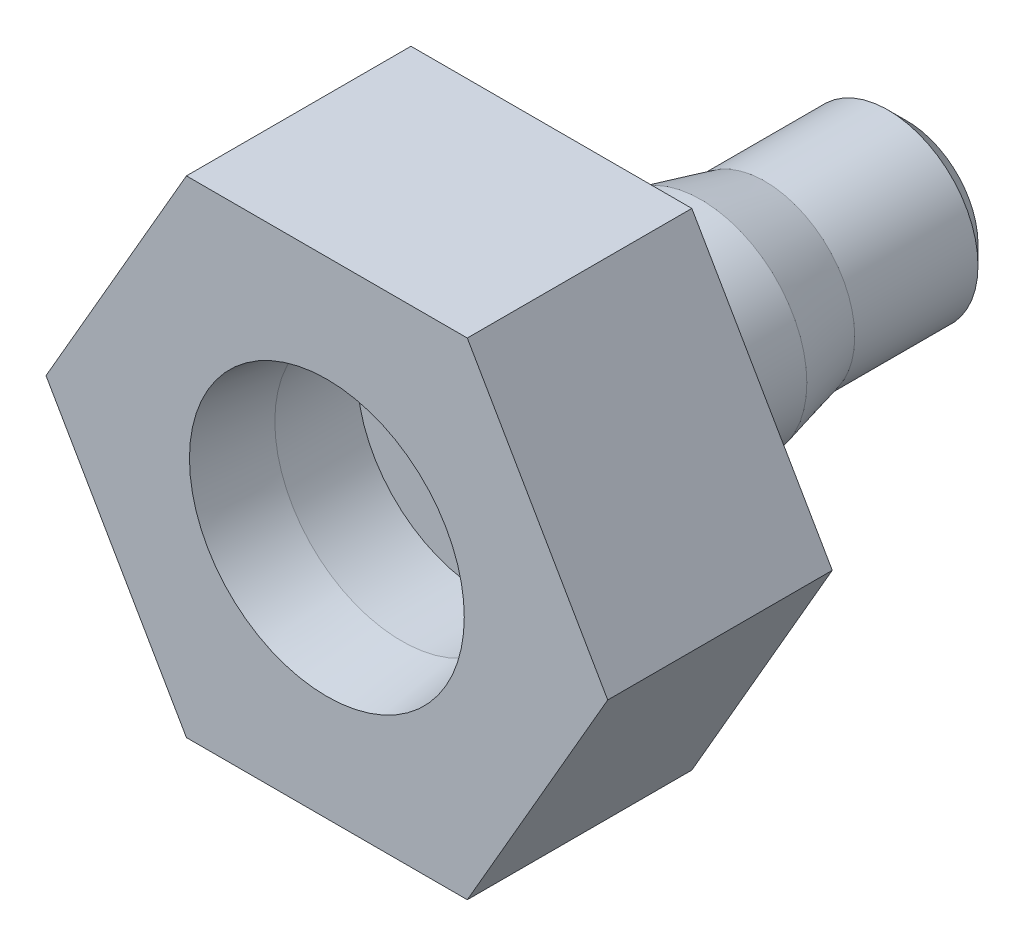
ISO-10303-21;
HEADER;
FILE_DESCRIPTION(('STEP AP214'),'2;1');
FILE_NAME('part.step','',(''),(''),'','','');
FILE_SCHEMA(('AUTOMOTIVE_DESIGN { 1 0 10303 214 1 1 1 1 }'));
ENDSEC;
DATA;
#1=APPLICATION_CONTEXT('core data for automotive mechanical design processes');
#2=APPLICATION_PROTOCOL_DEFINITION('international standard','automotive_design',2000,#1);
#3=PRODUCT_CONTEXT('',#1,'mechanical');
#4=PRODUCT('Part','Part','',(#3));
#5=PRODUCT_RELATED_PRODUCT_CATEGORY('part','',(#4));
#6=PRODUCT_DEFINITION_FORMATION('','',#4);
#7=PRODUCT_DEFINITION_CONTEXT('part definition',#1,'design');
#8=PRODUCT_DEFINITION('design','',#6,#7);
#9=PRODUCT_DEFINITION_SHAPE('','',#8);
#10=(LENGTH_UNIT() NAMED_UNIT(*) SI_UNIT(.MILLI.,.METRE.));
#11=(NAMED_UNIT(*) PLANE_ANGLE_UNIT() SI_UNIT($,.RADIAN.));
#12=(NAMED_UNIT(*) SI_UNIT($,.STERADIAN.) SOLID_ANGLE_UNIT());
#13=UNCERTAINTY_MEASURE_WITH_UNIT(LENGTH_MEASURE(1.E-05),#10,'distance_accuracy_value','');
#14=(GEOMETRIC_REPRESENTATION_CONTEXT(3) GLOBAL_UNCERTAINTY_ASSIGNED_CONTEXT((#13)) GLOBAL_UNIT_ASSIGNED_CONTEXT((#10,
#11,#12)) REPRESENTATION_CONTEXT('',''));
#15=CARTESIAN_POINT('',(0.,0.,0.));
#16=DIRECTION('',(0.,0.,1.));
#17=DIRECTION('',(1.,0.,0.));
#18=AXIS2_PLACEMENT_3D('',#15,#16,#17);
#19=CARTESIAN_POINT('',(0.,0.,-2.40416305603426));
#20=DIRECTION('',(0.,0.,1.));
#21=DIRECTION('',(1.,0.,0.));
#22=AXIS2_PLACEMENT_3D('',#19,#20,#21);
#23=CYLINDRICAL_SURFACE('',#22,0.85);
#24=CARTESIAN_POINT('',(0.,0.,0.));
#25=DIRECTION('',(0.,0.,1.));
#26=DIRECTION('',(1.,0.,0.));
#27=AXIS2_PLACEMENT_3D('',#24,#25,#26);
#28=CIRCLE('',#27,0.85);
#29=CARTESIAN_POINT('',(0.85,0.,0.));
#30=VERTEX_POINT('',#29);
#31=EDGE_CURVE('E146',#30,#30,#28,.F.);
#32=ORIENTED_EDGE('',*,*,#31,.T.);
#33=EDGE_LOOP('',(#32));
#34=FACE_BOUND('',#33,.T.);
#35=CARTESIAN_POINT('',(0.,0.,11.3));
#36=DIRECTION('',(0.,0.,1.));
#37=DIRECTION('',(1.,0.,0.));
#38=AXIS2_PLACEMENT_3D('',#35,#36,#37);
#39=CIRCLE('',#38,0.85);
#40=CARTESIAN_POINT('',(0.85,0.,11.3));
#41=VERTEX_POINT('',#40);
#42=EDGE_CURVE('E116',#41,#41,#39,.F.);
#43=ORIENTED_EDGE('',*,*,#42,.F.);
#44=EDGE_LOOP('',(#43));
#45=FACE_BOUND('',#44,.T.);
#46=ADVANCED_FACE('F44',(#34,#45),#23,.F.);
#47=CARTESIAN_POINT('',(0.,0.,0.));
#48=DIRECTION('',(0.,0.,1.));
#49=DIRECTION('',(1.,0.,0.));
#50=AXIS2_PLACEMENT_3D('',#47,#48,#49);
#51=PLANE('',#50);
#52=CARTESIAN_POINT('',(0.,0.,0.));
#53=DIRECTION('',(0.,0.,1.));
#54=DIRECTION('',(1.,0.,0.));
#55=AXIS2_PLACEMENT_3D('',#52,#53,#54);
#56=CIRCLE('',#55,1.9);
#57=CARTESIAN_POINT('',(1.9,0.,0.));
#58=VERTEX_POINT('',#57);
#59=EDGE_CURVE('E161',#58,#58,#56,.F.);
#60=ORIENTED_EDGE('',*,*,#59,.T.);
#61=EDGE_LOOP('',(#60));
#62=FACE_BOUND('',#61,.T.);
#63=ORIENTED_EDGE('',*,*,#31,.F.);
#64=EDGE_LOOP('',(#63));
#65=FACE_BOUND('',#64,.T.);
#66=ADVANCED_FACE('F184',(#62,#65),#51,.F.);
#67=CARTESIAN_POINT('',(0.,0.,9.5));
#68=DIRECTION('',(0.,0.,-1.));
#69=DIRECTION('',(-1.,0.,0.));
#70=AXIS2_PLACEMENT_3D('',#67,#68,#69);
#71=CYLINDRICAL_SURFACE('',#70,2.825);
#72=CARTESIAN_POINT('',(0.,0.,5.49865238330795));
#73=DIRECTION('',(0.,0.,1.));
#74=DIRECTION('',(1.,0.,0.));
#75=AXIS2_PLACEMENT_3D('',#72,#73,#74);
#76=CIRCLE('',#75,2.825);
#77=CARTESIAN_POINT('',(2.825,0.,5.49865238330795));
#78=VERTEX_POINT('',#77);
#79=EDGE_CURVE('E158',#78,#78,#76,.T.);
#80=ORIENTED_EDGE('',*,*,#79,.T.);
#81=EDGE_LOOP('',(#80));
#82=FACE_BOUND('',#81,.T.);
#83=CARTESIAN_POINT('',(0.,0.,8.50000000000001));
#84=DIRECTION('',(0.,0.,1.));
#85=DIRECTION('',(1.,0.,0.));
#86=AXIS2_PLACEMENT_3D('',#83,#84,#85);
#87=CIRCLE('',#86,2.825);
#88=CARTESIAN_POINT('',(2.825,0.,8.50000000000001));
#89=VERTEX_POINT('',#88);
#90=EDGE_CURVE('E152',#89,#89,#87,.F.);
#91=ORIENTED_EDGE('',*,*,#90,.T.);
#92=EDGE_LOOP('',(#91));
#93=FACE_BOUND('',#92,.T.);
#94=ADVANCED_FACE('F192',(#82,#93),#71,.T.);
#95=CARTESIAN_POINT('',(0.,0.,9.5));
#96=DIRECTION('',(0.,0.,1.));
#97=DIRECTION('',(1.,0.,0.));
#98=AXIS2_PLACEMENT_3D('',#95,#96,#97);
#99=PLANE('',#98);
#100=CARTESIAN_POINT('',(0.,0.,9.5));
#101=DIRECTION('',(0.,0.,1.));
#102=DIRECTION('',(1.,0.,0.));
#103=AXIS2_PLACEMENT_3D('',#100,#101,#102);
#104=CIRCLE('',#103,3.82500000000001);
#105=CARTESIAN_POINT('',(3.82500000000001,0.,9.5));
#106=VERTEX_POINT('',#105);
#107=EDGE_CURVE('E149',#106,#106,#104,.T.);
#108=ORIENTED_EDGE('',*,*,#107,.T.);
#109=EDGE_LOOP('',(#108));
#110=FACE_BOUND('',#109,.T.);
#111=DIRECTION('',(0.5,0.866025403784439,0.));
#112=VECTOR('',#111,1.);
#113=CARTESIAN_POINT('',(-3.75277674973257,6.5,9.5));
#114=LINE('',#113,#112);
#115=CARTESIAN_POINT('',(-7.50555349946514,0.,9.5));
#116=VERTEX_POINT('',#115);
#117=CARTESIAN_POINT('',(-3.75277674973257,6.5,9.5));
#118=VERTEX_POINT('',#117);
#119=EDGE_CURVE('E78',#116,#118,#114,.T.);
#120=ORIENTED_EDGE('',*,*,#119,.T.);
#121=DIRECTION('',(1.,0.,0.));
#122=VECTOR('',#121,1.);
#123=CARTESIAN_POINT('',(3.75277674973257,6.5,9.5));
#124=LINE('',#123,#122);
#125=CARTESIAN_POINT('',(3.75277674973257,6.5,9.5));
#126=VERTEX_POINT('',#125);
#127=EDGE_CURVE('E83',#118,#126,#124,.T.);
#128=ORIENTED_EDGE('',*,*,#127,.T.);
#129=DIRECTION('',(0.5,-0.866025403784439,0.));
#130=VECTOR('',#129,1.);
#131=CARTESIAN_POINT('',(7.50555349946513,0.,9.5));
#132=LINE('',#131,#130);
#133=CARTESIAN_POINT('',(7.50555349946513,0.,9.5));
#134=VERTEX_POINT('',#133);
#135=EDGE_CURVE('E120',#126,#134,#132,.T.);
#136=ORIENTED_EDGE('',*,*,#135,.T.);
#137=DIRECTION('',(-0.5,-0.866025403784439,0.));
#138=VECTOR('',#137,1.);
#139=CARTESIAN_POINT('',(3.75277674973257,-6.5,9.5));
#140=LINE('',#139,#138);
#141=CARTESIAN_POINT('',(3.75277674973257,-6.5,9.5));
#142=VERTEX_POINT('',#141);
#143=EDGE_CURVE('E62',#134,#142,#140,.T.);
#144=ORIENTED_EDGE('',*,*,#143,.T.);
#145=DIRECTION('',(-1.,0.,0.));
#146=VECTOR('',#145,1.);
#147=CARTESIAN_POINT('',(-3.75277674973257,-6.5,9.5));
#148=LINE('',#147,#146);
#149=CARTESIAN_POINT('',(-3.75277674973257,-6.5,9.5));
#150=VERTEX_POINT('',#149);
#151=EDGE_CURVE('E376',#142,#150,#148,.T.);
#152=ORIENTED_EDGE('',*,*,#151,.T.);
#153=DIRECTION('',(-0.5,0.866025403784439,0.));
#154=VECTOR('',#153,1.);
#155=CARTESIAN_POINT('',(-7.50555349946514,0.,9.5));
#156=LINE('',#155,#154);
#157=EDGE_CURVE('E371',#150,#116,#156,.T.);
#158=ORIENTED_EDGE('',*,*,#157,.T.);
#159=EDGE_LOOP('',(#120,#128,#136,#144,#152,#158));
#160=FACE_BOUND('',#159,.T.);
#161=ADVANCED_FACE('F203',(#110,#160),#99,.F.);
#162=CARTESIAN_POINT('',(0.,0.,9.5));
#163=DIRECTION('',(0.,0.,1.));
#164=DIRECTION('',(1.,0.,0.));
#165=AXIS2_PLACEMENT_3D('',#162,#163,#164);
#166=CONICAL_SURFACE('',#165,3.82500000000001,0.785398163397455);
#167=ORIENTED_EDGE('',*,*,#90,.F.);
#168=EDGE_LOOP('',(#167));
#169=FACE_BOUND('',#168,.T.);
#170=ORIENTED_EDGE('',*,*,#107,.F.);
#171=EDGE_LOOP('',(#170));
#172=FACE_BOUND('',#171,.T.);
#173=ADVANCED_FACE('F201',(#169,#172),#166,.T.);
#174=CARTESIAN_POINT('',(0.,0.,15.5));
#175=DIRECTION('',(0.,0.,1.));
#176=DIRECTION('',(1.,0.,0.));
#177=AXIS2_PLACEMENT_3D('',#174,#175,#176);
#178=PLANE('',#177);
#179=CARTESIAN_POINT('',(0.,0.,15.5));
#180=DIRECTION('',(0.,0.,1.));
#181=DIRECTION('',(1.,0.,0.));
#182=AXIS2_PLACEMENT_3D('',#179,#180,#181);
#183=CIRCLE('',#182,3.67198166940478);
#184=CARTESIAN_POINT('',(3.67198166940478,0.,15.5));
#185=VERTEX_POINT('',#184);
#186=EDGE_CURVE('E13',#185,#185,#183,.F.);
#187=ORIENTED_EDGE('',*,*,#186,.T.);
#188=EDGE_LOOP('',(#187));
#189=FACE_BOUND('',#188,.T.);
#190=DIRECTION('',(0.5,0.866025403784439,0.));
#191=VECTOR('',#190,1.);
#192=CARTESIAN_POINT('',(3.75277674973257,-6.5,15.5));
#193=LINE('',#192,#191);
#194=CARTESIAN_POINT('',(3.75277674973257,-6.5,15.5));
#195=VERTEX_POINT('',#194);
#196=CARTESIAN_POINT('',(7.50555349946513,0.,15.5));
#197=VERTEX_POINT('',#196);
#198=EDGE_CURVE('E95',#195,#197,#193,.T.);
#199=ORIENTED_EDGE('',*,*,#198,.T.);
#200=DIRECTION('',(-0.5,0.866025403784438,0.));
#201=VECTOR('',#200,1.);
#202=CARTESIAN_POINT('',(7.50555349946513,0.,15.5));
#203=LINE('',#202,#201);
#204=CARTESIAN_POINT('',(3.75277674973257,6.5,15.5));
#205=VERTEX_POINT('',#204);
#206=EDGE_CURVE('E109',#197,#205,#203,.T.);
#207=ORIENTED_EDGE('',*,*,#206,.T.);
#208=DIRECTION('',(-1.,0.,0.));
#209=VECTOR('',#208,1.);
#210=CARTESIAN_POINT('',(3.75277674973257,6.5,15.5));
#211=LINE('',#210,#209);
#212=CARTESIAN_POINT('',(-3.75277674973257,6.5,15.5));
#213=VERTEX_POINT('',#212);
#214=EDGE_CURVE('E113',#205,#213,#211,.T.);
#215=ORIENTED_EDGE('',*,*,#214,.T.);
#216=DIRECTION('',(-0.499999999999999,-0.866025403784439,0.));
#217=VECTOR('',#216,1.);
#218=CARTESIAN_POINT('',(-3.75277674973257,6.5,15.5));
#219=LINE('',#218,#217);
#220=CARTESIAN_POINT('',(-7.50555349946514,0.,15.5));
#221=VERTEX_POINT('',#220);
#222=EDGE_CURVE('E125',#213,#221,#219,.T.);
#223=ORIENTED_EDGE('',*,*,#222,.T.);
#224=DIRECTION('',(0.5,-0.866025403784438,0.));
#225=VECTOR('',#224,1.);
#226=CARTESIAN_POINT('',(-7.50555349946514,0.,15.5));
#227=LINE('',#226,#225);
#228=CARTESIAN_POINT('',(-3.75277674973257,-6.5,15.5));
#229=VERTEX_POINT('',#228);
#230=EDGE_CURVE('E127',#221,#229,#227,.T.);
#231=ORIENTED_EDGE('',*,*,#230,.T.);
#232=DIRECTION('',(1.,0.,0.));
#233=VECTOR('',#232,1.);
#234=CARTESIAN_POINT('',(-3.75277674973257,-6.5,15.5));
#235=LINE('',#234,#233);
#236=EDGE_CURVE('E132',#229,#195,#235,.T.);
#237=ORIENTED_EDGE('',*,*,#236,.T.);
#238=EDGE_LOOP('',(#199,#207,#215,#223,#231,#237));
#239=FACE_BOUND('',#238,.T.);
#240=ADVANCED_FACE('F111',(#189,#239),#178,.T.);
#241=CARTESIAN_POINT('',(3.75277674973257,6.5,-10.3578280114753));
#242=DIRECTION('',(0.,1.,0.));
#243=DIRECTION('',(0.,0.,1.));
#244=AXIS2_PLACEMENT_3D('',#241,#242,#243);
#245=PLANE('',#244);
#246=ORIENTED_EDGE('',*,*,#127,.F.);
#247=DIRECTION('',(0.,0.,1.));
#248=VECTOR('',#247,1.);
#249=CARTESIAN_POINT('',(-3.75277674973257,6.5,-10.3578280114753));
#250=LINE('',#249,#248);
#251=EDGE_CURVE('E121',#118,#213,#250,.T.);
#252=ORIENTED_EDGE('',*,*,#251,.T.);
#253=ORIENTED_EDGE('',*,*,#214,.F.);
#254=DIRECTION('',(0.,0.,1.));
#255=VECTOR('',#254,1.);
#256=CARTESIAN_POINT('',(3.75277674973257,6.5,-10.3578280114753));
#257=LINE('',#256,#255);
#258=EDGE_CURVE('E118',#126,#205,#257,.T.);
#259=ORIENTED_EDGE('',*,*,#258,.F.);
#260=EDGE_LOOP('',(#246,#252,#253,#259));
#261=FACE_BOUND('',#260,.T.);
#262=ADVANCED_FACE('F123',(#261),#245,.T.);
#263=CARTESIAN_POINT('',(-3.75277674973257,6.5,-10.3578280114753));
#264=DIRECTION('',(-0.866025403784439,0.5,0.));
#265=DIRECTION('',(-0.5,-0.866025403784439,0.));
#266=AXIS2_PLACEMENT_3D('',#263,#264,#265);
#267=PLANE('',#266);
#268=ORIENTED_EDGE('',*,*,#119,.F.);
#269=DIRECTION('',(0.,0.,1.));
#270=VECTOR('',#269,1.);
#271=CARTESIAN_POINT('',(-7.50555349946514,0.,-10.3578280114753));
#272=LINE('',#271,#270);
#273=EDGE_CURVE('E143',#116,#221,#272,.T.);
#274=ORIENTED_EDGE('',*,*,#273,.T.);
#275=ORIENTED_EDGE('',*,*,#222,.F.);
#276=ORIENTED_EDGE('',*,*,#251,.F.);
#277=EDGE_LOOP('',(#268,#274,#275,#276));
#278=FACE_BOUND('',#277,.T.);
#279=ADVANCED_FACE('F257',(#278),#267,.T.);
#280=CARTESIAN_POINT('',(-7.50555349946514,0.,-10.3578280114753));
#281=DIRECTION('',(-0.866025403784439,-0.5,0.));
#282=DIRECTION('',(0.5,-0.866025403784439,0.));
#283=AXIS2_PLACEMENT_3D('',#280,#281,#282);
#284=PLANE('',#283);
#285=ORIENTED_EDGE('',*,*,#157,.F.);
#286=DIRECTION('',(0.,0.,1.));
#287=VECTOR('',#286,1.);
#288=CARTESIAN_POINT('',(-3.75277674973257,-6.5,-10.3578280114753));
#289=LINE('',#288,#287);
#290=EDGE_CURVE('E140',#150,#229,#289,.T.);
#291=ORIENTED_EDGE('',*,*,#290,.T.);
#292=ORIENTED_EDGE('',*,*,#230,.F.);
#293=ORIENTED_EDGE('',*,*,#273,.F.);
#294=EDGE_LOOP('',(#285,#291,#292,#293));
#295=FACE_BOUND('',#294,.T.);
#296=ADVANCED_FACE('F253',(#295),#284,.T.);
#297=CARTESIAN_POINT('',(-3.75277674973257,-6.5,-10.3578280114753));
#298=DIRECTION('',(0.,-1.,0.));
#299=DIRECTION('',(1.,0.,0.));
#300=AXIS2_PLACEMENT_3D('',#297,#298,#299);
#301=PLANE('',#300);
#302=ORIENTED_EDGE('',*,*,#151,.F.);
#303=DIRECTION('',(0.,0.,1.));
#304=VECTOR('',#303,1.);
#305=CARTESIAN_POINT('',(3.75277674973257,-6.5,-10.3578280114753));
#306=LINE('',#305,#304);
#307=EDGE_CURVE('E137',#142,#195,#306,.T.);
#308=ORIENTED_EDGE('',*,*,#307,.T.);
#309=ORIENTED_EDGE('',*,*,#236,.F.);
#310=ORIENTED_EDGE('',*,*,#290,.F.);
#311=EDGE_LOOP('',(#302,#308,#309,#310));
#312=FACE_BOUND('',#311,.T.);
#313=ADVANCED_FACE('F250',(#312),#301,.T.);
#314=CARTESIAN_POINT('',(3.75277674973257,-6.5,-10.3578280114753));
#315=DIRECTION('',(0.866025403784439,-0.5,0.));
#316=DIRECTION('',(0.5,0.866025403784439,0.));
#317=AXIS2_PLACEMENT_3D('',#314,#315,#316);
#318=PLANE('',#317);
#319=ORIENTED_EDGE('',*,*,#143,.F.);
#320=DIRECTION('',(0.,0.,1.));
#321=VECTOR('',#320,1.);
#322=CARTESIAN_POINT('',(7.50555349946513,0.,-10.3578280114753));
#323=LINE('',#322,#321);
#324=EDGE_CURVE('E135',#134,#197,#323,.T.);
#325=ORIENTED_EDGE('',*,*,#324,.T.);
#326=ORIENTED_EDGE('',*,*,#198,.F.);
#327=ORIENTED_EDGE('',*,*,#307,.F.);
#328=EDGE_LOOP('',(#319,#325,#326,#327));
#329=FACE_BOUND('',#328,.T.);
#330=ADVANCED_FACE('F246',(#329),#318,.T.);
#331=CARTESIAN_POINT('',(7.50555349946513,0.,-10.3578280114753));
#332=DIRECTION('',(0.866025403784439,0.5,0.));
#333=DIRECTION('',(-0.5,0.866025403784439,0.));
#334=AXIS2_PLACEMENT_3D('',#331,#332,#333);
#335=PLANE('',#334);
#336=ORIENTED_EDGE('',*,*,#324,.F.);
#337=ORIENTED_EDGE('',*,*,#135,.F.);
#338=ORIENTED_EDGE('',*,*,#258,.T.);
#339=ORIENTED_EDGE('',*,*,#206,.F.);
#340=EDGE_LOOP('',(#336,#337,#338,#339));
#341=FACE_BOUND('',#340,.T.);
#342=ADVANCED_FACE('F119',(#341),#335,.T.);
#343=CARTESIAN_POINT('',(0.,0.,17.490306627408));
#344=DIRECTION('',(0.,0.,-1.));
#345=DIRECTION('',(-1.,0.,0.));
#346=AXIS2_PLACEMENT_3D('',#343,#344,#345);
#347=CYLINDRICAL_SURFACE('',#346,2.4);
#348=CARTESIAN_POINT('',(0.,0.,0.500000000000004));
#349=DIRECTION('',(0.,0.,1.));
#350=DIRECTION('',(1.,0.,0.));
#351=AXIS2_PLACEMENT_3D('',#348,#349,#350);
#352=CIRCLE('',#351,2.4);
#353=CARTESIAN_POINT('',(2.4,0.,0.500000000000004));
#354=VERTEX_POINT('',#353);
#355=EDGE_CURVE('E164',#354,#354,#352,.T.);
#356=ORIENTED_EDGE('',*,*,#355,.T.);
#357=EDGE_LOOP('',(#356));
#358=FACE_BOUND('',#357,.T.);
#359=CARTESIAN_POINT('',(0.,0.,3.79407048655519));
#360=DIRECTION('',(0.,0.,1.));
#361=DIRECTION('',(1.,0.,0.));
#362=AXIS2_PLACEMENT_3D('',#359,#360,#361);
#363=CIRCLE('',#362,2.4);
#364=CARTESIAN_POINT('',(2.4,0.,3.79407048655519));
#365=VERTEX_POINT('',#364);
#366=EDGE_CURVE('E155',#365,#365,#363,.F.);
#367=ORIENTED_EDGE('',*,*,#366,.T.);
#368=EDGE_LOOP('',(#367));
#369=FACE_BOUND('',#368,.T.);
#370=ADVANCED_FACE('F223',(#358,#369),#347,.T.);
#371=CARTESIAN_POINT('',(0.,0.,3.79407048655519));
#372=DIRECTION('',(0.,0.,1.));
#373=DIRECTION('',(1.,0.,0.));
#374=AXIS2_PLACEMENT_3D('',#371,#372,#373);
#375=CONICAL_SURFACE('',#374,2.4,0.244346095279203);
#376=ORIENTED_EDGE('',*,*,#79,.F.);
#377=EDGE_LOOP('',(#376));
#378=FACE_BOUND('',#377,.T.);
#379=ORIENTED_EDGE('',*,*,#366,.F.);
#380=EDGE_LOOP('',(#379));
#381=FACE_BOUND('',#380,.T.);
#382=ADVANCED_FACE('F217',(#378,#381),#375,.T.);
#383=CARTESIAN_POINT('',(0.,0.,0.));
#384=DIRECTION('',(0.,0.,1.));
#385=DIRECTION('',(1.,0.,0.));
#386=AXIS2_PLACEMENT_3D('',#383,#384,#385);
#387=CONICAL_SURFACE('',#386,1.9,0.785398163397449);
#388=ORIENTED_EDGE('',*,*,#355,.F.);
#389=EDGE_LOOP('',(#388));
#390=FACE_BOUND('',#389,.T.);
#391=ORIENTED_EDGE('',*,*,#59,.F.);
#392=EDGE_LOOP('',(#391));
#393=FACE_BOUND('',#392,.T.);
#394=ADVANCED_FACE('F222',(#390,#393),#387,.T.);
#395=CARTESIAN_POINT('',(0.,0.,11.3));
#396=DIRECTION('',(0.,0.,1.));
#397=DIRECTION('',(1.,0.,0.));
#398=AXIS2_PLACEMENT_3D('',#395,#396,#397);
#399=PLANE('',#398);
#400=CARTESIAN_POINT('',(0.,0.,11.3));
#401=DIRECTION('',(0.,0.,1.));
#402=DIRECTION('',(1.,0.,0.));
#403=AXIS2_PLACEMENT_3D('',#400,#401,#402);
#404=CIRCLE('',#403,3.3909);
#405=CARTESIAN_POINT('',(3.3909,0.,11.3));
#406=VERTEX_POINT('',#405);
#407=EDGE_CURVE('E168',#406,#406,#404,.T.);
#408=ORIENTED_EDGE('',*,*,#407,.T.);
#409=EDGE_LOOP('',(#408));
#410=FACE_BOUND('',#409,.T.);
#411=ORIENTED_EDGE('',*,*,#42,.T.);
#412=EDGE_LOOP('',(#411));
#413=FACE_BOUND('',#412,.T.);
#414=ADVANCED_FACE('F180',(#410,#413),#399,.T.);
#415=CARTESIAN_POINT('',(0.,0.,11.3));
#416=DIRECTION('',(0.,0.,1.));
#417=DIRECTION('',(1.,0.,0.));
#418=AXIS2_PLACEMENT_3D('',#415,#416,#417);
#419=CYLINDRICAL_SURFACE('',#418,3.3909);
#420=CARTESIAN_POINT('',(0.,0.,13.5));
#421=DIRECTION('',(0.,0.,1.));
#422=DIRECTION('',(1.,0.,0.));
#423=AXIS2_PLACEMENT_3D('',#420,#421,#422);
#424=CIRCLE('',#423,3.3909);
#425=CARTESIAN_POINT('',(3.3909,0.,13.5));
#426=VERTEX_POINT('',#425);
#427=EDGE_CURVE('E54',#426,#426,#424,.T.);
#428=ORIENTED_EDGE('',*,*,#427,.T.);
#429=EDGE_LOOP('',(#428));
#430=FACE_BOUND('',#429,.T.);
#431=ORIENTED_EDGE('',*,*,#407,.F.);
#432=EDGE_LOOP('',(#431));
#433=FACE_BOUND('',#432,.T.);
#434=ADVANCED_FACE('F172',(#430,#433),#419,.F.);
#435=CARTESIAN_POINT('',(0.,0.,13.5));
#436=DIRECTION('',(0.,0.,1.));
#437=DIRECTION('',(1.,0.,0.));
#438=AXIS2_PLACEMENT_3D('',#435,#436,#437);
#439=CONICAL_SURFACE('',#438,3.3909,0.139626340159544);
#440=ORIENTED_EDGE('',*,*,#186,.F.);
#441=EDGE_LOOP('',(#440));
#442=FACE_BOUND('',#441,.T.);
#443=ORIENTED_EDGE('',*,*,#427,.F.);
#444=EDGE_LOOP('',(#443));
#445=FACE_BOUND('',#444,.T.);
#446=ADVANCED_FACE('F47',(#442,#445),#439,.F.);
#447=CLOSED_SHELL('',(#46,#66,#94,#161,#173,#240,#262,#279,#296,#313,#330,#342,#370,#382,#394,
#414,#434,#446));
#448=MANIFOLD_SOLID_BREP('B2',#447);
#449=ADVANCED_BREP_SHAPE_REPRESENTATION('',(#18,#448),#14);
#450=SHAPE_DEFINITION_REPRESENTATION(#9,#449);
ENDSEC;
END-ISO-10303-21;
